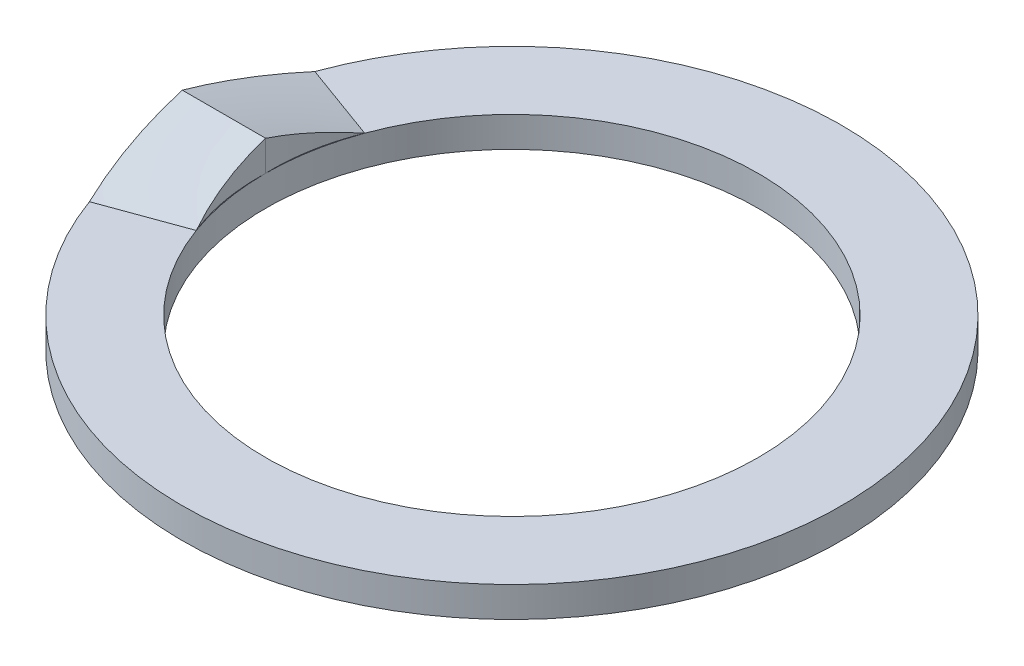
ISO-10303-21;
HEADER;
FILE_DESCRIPTION(('STEP AP214'),'2;1');
FILE_NAME('part.step','',(''),(''),'','','');
FILE_SCHEMA(('AUTOMOTIVE_DESIGN { 1 0 10303 214 1 1 1 1 }'));
ENDSEC;
DATA;
#1=APPLICATION_CONTEXT('core data for automotive mechanical design processes');
#2=APPLICATION_PROTOCOL_DEFINITION('international standard','automotive_design',2000,#1);
#3=PRODUCT_CONTEXT('',#1,'mechanical');
#4=PRODUCT('Part','Part','',(#3));
#5=PRODUCT_RELATED_PRODUCT_CATEGORY('part','',(#4));
#6=PRODUCT_DEFINITION_FORMATION('','',#4);
#7=PRODUCT_DEFINITION_CONTEXT('part definition',#1,'design');
#8=PRODUCT_DEFINITION('design','',#6,#7);
#9=PRODUCT_DEFINITION_SHAPE('','',#8);
#10=(LENGTH_UNIT() NAMED_UNIT(*) SI_UNIT(.MILLI.,.METRE.));
#11=(NAMED_UNIT(*) PLANE_ANGLE_UNIT() SI_UNIT($,.RADIAN.));
#12=(NAMED_UNIT(*) SI_UNIT($,.STERADIAN.) SOLID_ANGLE_UNIT());
#13=UNCERTAINTY_MEASURE_WITH_UNIT(LENGTH_MEASURE(1.E-05),#10,'distance_accuracy_value','');
#14=(GEOMETRIC_REPRESENTATION_CONTEXT(3) GLOBAL_UNCERTAINTY_ASSIGNED_CONTEXT((#13)) GLOBAL_UNIT_ASSIGNED_CONTEXT((#10,
#11,#12)) REPRESENTATION_CONTEXT('',''));
#15=CARTESIAN_POINT('',(0.,0.,0.));
#16=DIRECTION('',(0.,0.,1.));
#17=DIRECTION('',(1.,0.,0.));
#18=AXIS2_PLACEMENT_3D('',#15,#16,#17);
#19=CARTESIAN_POINT('',(0.,10.,0.));
#20=DIRECTION('',(0.,1.,0.));
#21=DIRECTION('',(0.,0.,1.));
#22=AXIS2_PLACEMENT_3D('',#19,#20,#21);
#23=PLANE('',#22);
#24=CARTESIAN_POINT('',(-152.70005087771,10.,55.5782732904213));
#25=CARTESIAN_POINT('',(-153.317086146041,10.,54.0235545216951));
#26=CARTESIAN_POINT('',(-153.905934350648,10.,52.4578250659601));
#27=CARTESIAN_POINT('',(-155.026817901048,10.,49.3061513481684));
#28=CARTESIAN_POINT('',(-155.558852982663,10.,47.720206992152));
#29=CARTESIAN_POINT('',(-157.068738983133,10.,42.9358392385224));
#30=CARTESIAN_POINT('',(-157.96077968991,10.,39.7098495688334));
#31=CARTESIAN_POINT('',(-159.440412776128,10.,33.5024585014175));
#32=CARTESIAN_POINT('',(-160.048474678407,10.,30.5258859290327));
#33=CARTESIAN_POINT('',(-161.070322970234,10.,24.5396154395836));
#34=CARTESIAN_POINT('',(-161.484115025148,10.,21.5299184911242));
#35=CARTESIAN_POINT('',(-162.120856086308,10.,15.4371924558219));
#36=CARTESIAN_POINT('',(-162.340358753481,10.,12.3537986653587));
#37=CARTESIAN_POINT('',(-162.515842171606,10.,7.7232167430563));
#38=CARTESIAN_POINT('',(-162.548703197381,10.,6.17859804990309));
#39=CARTESIAN_POINT('',(-162.562978128496,10.,3.08911285001207));
#40=CARTESIAN_POINT('',(-162.544391668602,10.,1.54424634159284));
#41=CARTESIAN_POINT('',(-162.5,10.,0.));
#42=B_SPLINE_CURVE_WITH_KNOTS('',3,(#24,#25,#26,#27,#28,#29,#30,#31,#32,#33,#34,#35,#36,#37,#38,
#39,#40,#41),.UNSPECIFIED.,.F.,.F.,(4,2,2,2,2,2,2,2,4),(0.,5.01746544112292,10.0349542121342,
20.0666103301966,29.1746023680965,38.2823287789988,47.5485469510787,52.182711428757,
56.8169088052858),.UNSPECIFIED.);
#43=CARTESIAN_POINT('',(-152.70005087771,10.,55.5782732904212));
#44=VERTEX_POINT('',#43);
#45=CARTESIAN_POINT('',(-162.5,10.,0.));
#46=VERTEX_POINT('',#45);
#47=EDGE_CURVE('E249',#44,#46,#42,.T.);
#48=ORIENTED_EDGE('',*,*,#47,.F.);
#49=CARTESIAN_POINT('',(0.,10.,0.));
#50=DIRECTION('',(0.,1.,0.));
#51=DIRECTION('',(0.,0.,1.));
#52=AXIS2_PLACEMENT_3D('',#49,#50,#51);
#53=CIRCLE('',#52,162.5);
#54=EDGE_CURVE('E693',#46,#44,#53,.T.);
#55=ORIENTED_EDGE('',*,*,#54,.F.);
#56=EDGE_LOOP('',(#48,#55));
#57=FACE_BOUND('',#56,.T.);
#58=ADVANCED_FACE('F223',(#57),#23,.T.);
#59=DIRECTION('',(-0.939692620785908,0.,0.342020143325669));
#60=VECTOR('',#59,1.);
#61=CARTESIAN_POINT('',(-204.383145020935,10.,74.3893811733331));
#62=LINE('',#61,#60);
#63=CARTESIAN_POINT('',(-204.383145020935,10.,74.389381173333));
#64=VERTEX_POINT('',#63);
#65=EDGE_CURVE('E241',#44,#64,#62,.T.);
#66=ORIENTED_EDGE('',*,*,#65,.T.);
#67=CARTESIAN_POINT('',(0.,10.,0.));
#68=DIRECTION('',(0.,1.,0.));
#69=DIRECTION('',(0.,0.,1.));
#70=AXIS2_PLACEMENT_3D('',#67,#68,#69);
#71=CIRCLE('',#70,217.5);
#72=CARTESIAN_POINT('',(-204.383145020935,10.,-74.3893811733331));
#73=VERTEX_POINT('',#72);
#74=EDGE_CURVE('E689',#64,#73,#71,.T.);
#75=ORIENTED_EDGE('',*,*,#74,.T.);
#76=DIRECTION('',(-0.939692620785908,0.,-0.342020143325669));
#77=VECTOR('',#76,1.);
#78=CARTESIAN_POINT('',(-204.383145020935,10.,-74.3893811733331));
#79=LINE('',#78,#77);
#80=CARTESIAN_POINT('',(-152.70005087771,10.,-55.5782732904213));
#81=VERTEX_POINT('',#80);
#82=EDGE_CURVE('E589',#81,#73,#79,.T.);
#83=ORIENTED_EDGE('',*,*,#82,.F.);
#84=EDGE_CURVE('E691',#44,#81,#53,.T.);
#85=ORIENTED_EDGE('',*,*,#84,.F.);
#86=EDGE_LOOP('',(#66,#75,#83,#85));
#87=FACE_BOUND('',#86,.T.);
#88=ADVANCED_FACE('F744',(#87),#23,.T.);
#89=CARTESIAN_POINT('',(0.,-10.,0.));
#90=DIRECTION('',(0.,1.,0.));
#91=DIRECTION('',(0.,0.,1.));
#92=AXIS2_PLACEMENT_3D('',#89,#90,#91);
#93=PLANE('',#92);
#94=CARTESIAN_POINT('',(-217.5,-10.,0.));
#95=CARTESIAN_POINT('',(-217.425850894036,-10.,3.33634458979422));
#96=CARTESIAN_POINT('',(-217.283734331814,-10.,6.67113297407033));
#97=CARTESIAN_POINT('',(-216.864965172838,-10.,13.3319308575212));
#98=CARTESIAN_POINT('',(-216.588325753956,-9.99999999999999,16.6579411845149));
#99=CARTESIAN_POINT('',(-215.901901417388,-9.99999999999999,23.2961070775179));
#100=CARTESIAN_POINT('',(-215.492119108044,-10.,26.6082629136568));
#101=CARTESIAN_POINT('',(-214.540507271924,-10.,33.2138699450945));
#102=CARTESIAN_POINT('',(-213.998666053999,-10.,36.5073194578954));
#103=CARTESIAN_POINT('',(-212.848721037228,-10.,42.7199600969706));
#104=CARTESIAN_POINT('',(-212.253845690097,-10.,45.6416081151872));
#105=CARTESIAN_POINT('',(-210.960033654815,-10.,51.4620038890468));
#106=CARTESIAN_POINT('',(-210.26108978393,-10.,54.3607500494662));
#107=CARTESIAN_POINT('',(-208.759230825878,-10.,60.1329196138594));
#108=CARTESIAN_POINT('',(-207.956257818888,-10.,63.0063279515379));
#109=CARTESIAN_POINT('',(-206.247055894203,-10.,68.7220871107759));
#110=CARTESIAN_POINT('',(-205.34083280447,-10.,71.5644396753668));
#111=CARTESIAN_POINT('',(-204.383145020935,-10.,74.3893811733331));
#112=B_SPLINE_CURVE_WITH_KNOTS('',3,(#94,#95,#96,#97,#98,#99,#100,#101,#102,#103,#104,#105,#106,
#107,#108,#109,#110,#111),.UNSPECIFIED.,.F.,.F.,(4,2,2,2,2,2,2,2,4),(0.,10.0107487240745,
20.0205169917112,30.0300891743927,40.0405478244977,48.9834722689744,57.9270142340191,
66.8755572268938,75.8235953682988),.UNSPECIFIED.);
#113=CARTESIAN_POINT('',(-213.769840690063,-9.99999999999999,37.6938995644913));
#114=VERTEX_POINT('',#113);
#115=CARTESIAN_POINT('',(-204.383145020935,-10.,74.3893811733331));
#116=VERTEX_POINT('',#115);
#117=EDGE_CURVE('E324',#114,#116,#112,.T.);
#118=ORIENTED_EDGE('',*,*,#117,.T.);
#119=CARTESIAN_POINT('',(0.,-10.,0.));
#120=DIRECTION('',(0.,1.,0.));
#121=DIRECTION('',(0.,0.,1.));
#122=AXIS2_PLACEMENT_3D('',#119,#120,#121);
#123=CIRCLE('',#122,217.5);
#124=CARTESIAN_POINT('',(-204.383145020935,-10.,-74.3893811733331));
#125=VERTEX_POINT('',#124);
#126=EDGE_CURVE('E329',#125,#116,#123,.T.);
#127=ORIENTED_EDGE('',*,*,#126,.F.);
#128=CARTESIAN_POINT('',(-204.383145020935,-10.,-74.3893811733331));
#129=CARTESIAN_POINT('',(-205.454580267854,-10.,-71.2288865345536));
#130=CARTESIAN_POINT('',(-206.46160865871,-10.,-68.0466057714099));
#131=CARTESIAN_POINT('',(-208.346231180248,-9.99999999999999,-61.6442774219037));
#132=CARTESIAN_POINT('',(-209.223838003879,-9.99999999999999,-58.4242335726179));
#133=CARTESIAN_POINT('',(-210.849191377034,-9.99999999999999,-51.9516255878924));
#134=CARTESIAN_POINT('',(-211.596940478527,-10.,-48.6990620928586));
#135=CARTESIAN_POINT('',(-212.961955018722,-10.,-42.1663483026159));
#136=CARTESIAN_POINT('',(-213.57920888014,-10.,-38.886195586565));
#137=CARTESIAN_POINT('',(-214.623447653453,-10.,-32.6549155254199));
#138=CARTESIAN_POINT('',(-215.063703490997,-10.,-29.7060038076329));
#139=CARTESIAN_POINT('',(-215.838599968877,-10.,-23.7941090234034));
#140=CARTESIAN_POINT('',(-216.173233311842,-10.,-20.8311249990657));
#141=CARTESIAN_POINT('',(-216.736143217229,-10.,-14.893394185876));
#142=CARTESIAN_POINT('',(-216.964360249274,-10.,-11.9186417497027));
#143=CARTESIAN_POINT('',(-217.313151041496,-10.,-5.9630062900678));
#144=CARTESIAN_POINT('',(-217.433730882652,-10.,-2.98212362247232));
#145=CARTESIAN_POINT('',(-217.5,-10.,0.));
#146=B_SPLINE_CURVE_WITH_KNOTS('',3,(#128,#129,#130,#131,#132,#133,#134,#135,#136,#137,#138,
#139,#140,#141,#142,#143,#144,#145),.UNSPECIFIED.,.F.,.F.,(4,2,2,2,2,2,2,2,4),(0.,
10.0107512961125,20.0205201394985,30.0300922483265,40.040552014586,48.9834773803632,
57.9270204702527,66.8755606854243,75.8235953195433),.UNSPECIFIED.);
#147=CARTESIAN_POINT('',(-213.769840690063,-9.99999999999999,-37.6938995644913));
#148=VERTEX_POINT('',#147);
#149=EDGE_CURVE('E722',#125,#148,#146,.T.);
#150=ORIENTED_EDGE('',*,*,#149,.T.);
#151=CARTESIAN_POINT('',(-155.094138911286,-10.,-27.3477902289091));
#152=CARTESIAN_POINT('',(-156.872190480335,-10.,-27.661308693647));
#153=CARTESIAN_POINT('',(-158.650242049386,-10.,-27.9748271583779));
#154=CARTESIAN_POINT('',(-164.94199581974,-10.,-29.0842331041012));
#155=CARTESIAN_POINT('',(-169.455698021049,-10.,-29.8801205850614));
#156=CARTESIAN_POINT('',(-178.483102423673,-10.,-31.4718955469384));
#157=CARTESIAN_POINT('',(-182.996804624989,-10.,-32.2677830278552));
#158=CARTESIAN_POINT('',(-192.02420902761,-9.99999999999999,-33.8595579897505));
#159=CARTESIAN_POINT('',(-196.537911228915,-9.99999999999999,-34.6554454707289));
#160=CARTESIAN_POINT('',(-207.069074085886,-9.99999999999999,-36.512373620697));
#161=CARTESIAN_POINT('',(-213.08653474155,-9.99999999999999,-37.5734142896987));
#162=CARTESIAN_POINT('',(-219.103995397214,-10.,-38.6344549586917));
#163=B_SPLINE_CURVE_WITH_KNOTS('',3,(#151,#152,#153,#154,#155,#156,#157,#158,#159,#160,#161,
#162),.UNSPECIFIED.,.F.,.F.,(4,2,2,2,2,4),(0.,5.41644264156718,19.1664426415676,
32.9164426415679,46.6664426415683,64.9973116988058),.UNSPECIFIED.);
#164=CARTESIAN_POINT('',(-160.428293618447,-10.,-28.2883456230553));
#165=VERTEX_POINT('',#164);
#166=EDGE_CURVE('E233',#148,#165,#163,.F.);
#167=ORIENTED_EDGE('',*,*,#166,.T.);
#168=CARTESIAN_POINT('',(-162.5,-10.,0.));
#169=CARTESIAN_POINT('',(-162.54806156742,-10.,-1.67199453792795));
#170=CARTESIAN_POINT('',(-162.565874602785,-10.,-3.34469483734242));
#171=CARTESIAN_POINT('',(-162.541207623611,-9.99999999999999,-6.68965989156582));
#172=CARTESIAN_POINT('',(-162.498727323081,-9.99999999999998,-8.36192464427118));
#173=CARTESIAN_POINT('',(-162.281200063599,-10.,-13.3741680358731));
#174=CARTESIAN_POINT('',(-162.016098190012,-10.0000000000002,-16.7107019451459));
#175=CARTESIAN_POINT('',(-161.283469681927,-10.0000000000002,-23.0498074034538));
#176=CARTESIAN_POINT('',(-160.836828736567,-10.0000000000001,-26.0548421098906));
#177=CARTESIAN_POINT('',(-159.749657336494,-9.99999999999994,-32.0295927500768));
#178=CARTESIAN_POINT('',(-159.10913261911,-10.,-34.999309726232));
#179=CARTESIAN_POINT('',(-157.623657854408,-10.,-40.9423831520845));
#180=CARTESIAN_POINT('',(-156.775344172556,-10.,-43.9149035110329));
#181=CARTESIAN_POINT('',(-155.356483478295,-10.,-48.3262477509481));
#182=CARTESIAN_POINT('',(-154.859066339023,-10.,-49.7889542255324));
#183=CARTESIAN_POINT('',(-153.815796785975,-10.,-52.6970017411244));
#184=CARTESIAN_POINT('',(-153.269944024813,-10.,-54.1423426574997));
#185=CARTESIAN_POINT('',(-152.70005087771,-10.,-55.5782732904213));
#186=B_SPLINE_CURVE_WITH_KNOTS('',3,(#168,#169,#170,#171,#172,#173,#174,#175,#176,#177,#178,
#179,#180,#181,#182,#183,#184,#185),.UNSPECIFIED.,.F.,.F.,(4,2,2,2,2,2,2,2,4),(0.,
5.01745907390901,10.0349419473603,20.0665956551383,29.1745869590819,38.2823087693499,
47.5485328951989,52.1827042526712,56.8169088496613),.UNSPECIFIED.);
#187=CARTESIAN_POINT('',(-152.70005087771,-10.,-55.5782732904213));
#188=VERTEX_POINT('',#187);
#189=EDGE_CURVE('E301',#165,#188,#186,.T.);
#190=ORIENTED_EDGE('',*,*,#189,.T.);
#191=CARTESIAN_POINT('',(0.,-10.,0.));
#192=DIRECTION('',(0.,1.,0.));
#193=DIRECTION('',(0.,0.,1.));
#194=AXIS2_PLACEMENT_3D('',#191,#192,#193);
#195=CIRCLE('',#194,162.5);
#196=CARTESIAN_POINT('',(-152.70005087771,-10.,55.5782732904213));
#197=VERTEX_POINT('',#196);
#198=EDGE_CURVE('E294',#188,#197,#195,.T.);
#199=ORIENTED_EDGE('',*,*,#198,.T.);
#200=CARTESIAN_POINT('',(-152.70005087771,-10.,55.5782732904213));
#201=CARTESIAN_POINT('',(-153.317086146041,-10.,54.0235545216951));
#202=CARTESIAN_POINT('',(-153.905934350648,-10.,52.4578250659601));
#203=CARTESIAN_POINT('',(-155.026817901048,-10.,49.3061513481684));
#204=CARTESIAN_POINT('',(-155.558852982663,-10.,47.720206992152));
#205=CARTESIAN_POINT('',(-157.068738983134,-10.,42.9358392385224));
#206=CARTESIAN_POINT('',(-157.96077968991,-10.,39.7098495688334));
#207=CARTESIAN_POINT('',(-159.440412776128,-10.,33.5024585014176));
#208=CARTESIAN_POINT('',(-160.048474678407,-10.,30.5258859290327));
#209=CARTESIAN_POINT('',(-161.070322970234,-9.99999999999999,24.5396154395836));
#210=CARTESIAN_POINT('',(-161.484115025148,-9.99999999999999,21.5299184911242));
#211=CARTESIAN_POINT('',(-162.120856086308,-9.99999999999999,15.4371924558219));
#212=CARTESIAN_POINT('',(-162.34035875348,-10.,12.3537986653587));
#213=CARTESIAN_POINT('',(-162.515842171606,-10.,7.72321674305629));
#214=CARTESIAN_POINT('',(-162.548703197381,-10.,6.17859804990308));
#215=CARTESIAN_POINT('',(-162.562978128496,-10.,3.08911285001207));
#216=CARTESIAN_POINT('',(-162.544391668602,-10.,1.54424634159284));
#217=CARTESIAN_POINT('',(-162.5,-10.,0.));
#218=B_SPLINE_CURVE_WITH_KNOTS('',3,(#200,#201,#202,#203,#204,#205,#206,#207,#208,#209,#210,
#211,#212,#213,#214,#215,#216,#217),.UNSPECIFIED.,.F.,.F.,(4,2,2,2,2,2,2,2,4),(0.,
5.0174654411229,10.0349542121342,20.0666103301966,29.1746023680965,38.2823287789988,
47.5485469510787,52.182711428757,56.8169088052858),.UNSPECIFIED.);
#219=CARTESIAN_POINT('',(-160.428293618447,-10.,28.2883456230553));
#220=VERTEX_POINT('',#219);
#221=EDGE_CURVE('E298',#197,#220,#218,.T.);
#222=ORIENTED_EDGE('',*,*,#221,.T.);
#223=CARTESIAN_POINT('',(-155.094138911286,-10.,27.3477902289091));
#224=CARTESIAN_POINT('',(-156.872190480335,-10.,27.661308693647));
#225=CARTESIAN_POINT('',(-158.650242049386,-10.,27.9748271583779));
#226=CARTESIAN_POINT('',(-164.94199581974,-10.,29.0842331041012));
#227=CARTESIAN_POINT('',(-169.455698021049,-10.,29.8801205850614));
#228=CARTESIAN_POINT('',(-178.483102423673,-10.,31.4718955469384));
#229=CARTESIAN_POINT('',(-182.996804624989,-9.99999999999999,32.2677830278552));
#230=CARTESIAN_POINT('',(-192.02420902761,-9.99999999999999,33.8595579897505));
#231=CARTESIAN_POINT('',(-196.537911228915,-9.99999999999998,34.6554454707289));
#232=CARTESIAN_POINT('',(-207.069074085886,-9.99999999999998,36.512373620697));
#233=CARTESIAN_POINT('',(-213.08653474155,-9.99999999999999,37.5734142896987));
#234=CARTESIAN_POINT('',(-219.103995397214,-10.,38.6344549586917));
#235=B_SPLINE_CURVE_WITH_KNOTS('',3,(#223,#224,#225,#226,#227,#228,#229,#230,#231,#232,#233,
#234),.UNSPECIFIED.,.F.,.F.,(4,2,2,2,2,4),(0.,5.41644264156718,19.1664426415676,
32.9164426415679,46.6664426415683,64.9973116988058),.UNSPECIFIED.);
#236=EDGE_CURVE('E13',#220,#114,#235,.T.);
#237=ORIENTED_EDGE('',*,*,#236,.T.);
#238=EDGE_LOOP('',(#118,#127,#150,#167,#190,#199,#222,#237));
#239=FACE_BOUND('',#238,.T.);
#240=ADVANCED_FACE('F297',(#239),#93,.F.);
#241=CARTESIAN_POINT('',(-217.5,10.,0.));
#242=CARTESIAN_POINT('',(-217.425850894036,10.,3.33634458979423));
#243=CARTESIAN_POINT('',(-217.283734331814,10.,6.67113297407034));
#244=CARTESIAN_POINT('',(-216.864965172838,10.,13.3319308575212));
#245=CARTESIAN_POINT('',(-216.588325753956,10.,16.6579411845149));
#246=CARTESIAN_POINT('',(-215.901901417388,10.,23.2961070775179));
#247=CARTESIAN_POINT('',(-215.492119108044,10.,26.6082629136568));
#248=CARTESIAN_POINT('',(-214.540507271924,10.,33.2138699450945));
#249=CARTESIAN_POINT('',(-213.998666053999,10.,36.5073194578954));
#250=CARTESIAN_POINT('',(-212.848721037228,10.,42.7199600969706));
#251=CARTESIAN_POINT('',(-212.253845690097,10.,45.6416081151872));
#252=CARTESIAN_POINT('',(-210.960033654815,10.,51.4620038890468));
#253=CARTESIAN_POINT('',(-210.26108978393,10.,54.3607500494662));
#254=CARTESIAN_POINT('',(-208.759230825878,10.,60.1329196138594));
#255=CARTESIAN_POINT('',(-207.956257818888,10.,63.0063279515379));
#256=CARTESIAN_POINT('',(-206.247055894203,10.,68.7220871107759));
#257=CARTESIAN_POINT('',(-205.34083280447,10.,71.5644396753668));
#258=CARTESIAN_POINT('',(-204.383145020935,10.,74.3893811733331));
#259=B_SPLINE_CURVE_WITH_KNOTS('',3,(#241,#242,#243,#244,#245,#246,#247,#248,#249,#250,#251,
#252,#253,#254,#255,#256,#257,#258),.UNSPECIFIED.,.F.,.F.,(4,2,2,2,2,2,2,2,4),(0.,
10.0107487240745,20.0205169917112,30.0300891743927,40.0405478244977,48.9834722689744,
57.9270142340191,66.8755572268938,75.8235953682988),.UNSPECIFIED.);
#260=CARTESIAN_POINT('',(-217.5,10.,0.));
#261=VERTEX_POINT('',#260);
#262=EDGE_CURVE('E314',#261,#64,#259,.T.);
#263=ORIENTED_EDGE('',*,*,#262,.F.);
#264=EDGE_CURVE('E687',#261,#64,#71,.T.);
#265=ORIENTED_EDGE('',*,*,#264,.T.);
#266=EDGE_LOOP('',(#263,#265));
#267=FACE_BOUND('',#266,.T.);
#268=ADVANCED_FACE('F748',(#267),#23,.T.);
#269=CARTESIAN_POINT('',(-162.5,10.,0.));
#270=CARTESIAN_POINT('',(-162.54806156742,10.,-1.67199453792795));
#271=CARTESIAN_POINT('',(-162.565874602785,10.,-3.34469483734243));
#272=CARTESIAN_POINT('',(-162.541207623611,10.,-6.68965989156583));
#273=CARTESIAN_POINT('',(-162.498727323081,10.,-8.36192464427119));
#274=CARTESIAN_POINT('',(-162.281200063599,10.,-13.3741680358731));
#275=CARTESIAN_POINT('',(-162.016098190012,10.,-16.7107019451459));
#276=CARTESIAN_POINT('',(-161.283469681927,10.,-23.0498074034538));
#277=CARTESIAN_POINT('',(-160.836828736567,10.,-26.0548421098907));
#278=CARTESIAN_POINT('',(-159.749657336494,10.,-32.0295927500768));
#279=CARTESIAN_POINT('',(-159.10913261911,10.,-34.999309726232));
#280=CARTESIAN_POINT('',(-157.623657854408,10.,-40.9423831520845));
#281=CARTESIAN_POINT('',(-156.775344172556,10.,-43.9149035110329));
#282=CARTESIAN_POINT('',(-155.356483478295,10.,-48.3262477509481));
#283=CARTESIAN_POINT('',(-154.859066339023,10.,-49.7889542255324));
#284=CARTESIAN_POINT('',(-153.815796785975,10.,-52.6970017411244));
#285=CARTESIAN_POINT('',(-153.269944024813,10.,-54.1423426574997));
#286=CARTESIAN_POINT('',(-152.70005087771,10.,-55.5782732904213));
#287=B_SPLINE_CURVE_WITH_KNOTS('',3,(#269,#270,#271,#272,#273,#274,#275,#276,#277,#278,#279,
#280,#281,#282,#283,#284,#285,#286),.UNSPECIFIED.,.F.,.F.,(4,2,2,2,2,2,2,2,4),(0.,
5.01745907390902,10.0349419473603,20.0665956551383,29.1745869590819,38.28230876935,
47.5485328951989,52.1827042526712,56.8169088496613),.UNSPECIFIED.);
#288=EDGE_CURVE('E587',#46,#81,#287,.T.);
#289=ORIENTED_EDGE('',*,*,#288,.F.);
#290=EDGE_CURVE('E713',#81,#46,#53,.T.);
#291=ORIENTED_EDGE('',*,*,#290,.F.);
#292=EDGE_LOOP('',(#289,#291));
#293=FACE_BOUND('',#292,.T.);
#294=ADVANCED_FACE('F750',(#293),#23,.T.);
#295=CARTESIAN_POINT('',(0.,-10.,0.));
#296=DIRECTION('',(0.,1.,0.));
#297=DIRECTION('',(0.,0.,1.));
#298=AXIS2_PLACEMENT_3D('',#295,#296,#297);
#299=CYLINDRICAL_SURFACE('',#298,217.5);
#300=ORIENTED_EDGE('',*,*,#126,.T.);
#301=EDGE_CURVE('E323',#116,#125,#123,.T.);
#302=ORIENTED_EDGE('',*,*,#301,.T.);
#303=EDGE_LOOP('',(#300,#302));
#304=FACE_BOUND('',#303,.T.);
#305=ORIENTED_EDGE('',*,*,#74,.F.);
#306=ORIENTED_EDGE('',*,*,#264,.F.);
#307=EDGE_CURVE('E688',#73,#261,#71,.T.);
#308=ORIENTED_EDGE('',*,*,#307,.F.);
#309=EDGE_LOOP('',(#305,#306,#308));
#310=FACE_BOUND('',#309,.T.);
#311=ADVANCED_FACE('F225',(#304,#310),#299,.T.);
#312=CARTESIAN_POINT('',(0.,-10.,0.));
#313=DIRECTION('',(0.,1.,0.));
#314=DIRECTION('',(0.,0.,1.));
#315=AXIS2_PLACEMENT_3D('',#312,#313,#314);
#316=CYLINDRICAL_SURFACE('',#315,162.5);
#317=EDGE_CURVE('E306',#197,#188,#195,.T.);
#318=ORIENTED_EDGE('',*,*,#317,.F.);
#319=ORIENTED_EDGE('',*,*,#198,.F.);
#320=EDGE_LOOP('',(#318,#319));
#321=FACE_BOUND('',#320,.T.);
#322=ORIENTED_EDGE('',*,*,#54,.T.);
#323=ORIENTED_EDGE('',*,*,#84,.T.);
#324=ORIENTED_EDGE('',*,*,#290,.T.);
#325=EDGE_LOOP('',(#322,#323,#324));
#326=FACE_BOUND('',#325,.T.);
#327=ADVANCED_FACE('F327',(#321,#326),#316,.F.);
#328=ORIENTED_EDGE('',*,*,#301,.F.);
#329=DIRECTION('',(0.939692620785908,0.,-0.342020143325669));
#330=VECTOR('',#329,1.);
#331=CARTESIAN_POINT('',(-204.383145020935,-10.,74.3893811733331));
#332=LINE('',#331,#330);
#333=EDGE_CURVE('E227',#116,#197,#332,.T.);
#334=ORIENTED_EDGE('',*,*,#333,.T.);
#335=ORIENTED_EDGE('',*,*,#317,.T.);
#336=DIRECTION('',(0.939692620785908,0.,0.342020143325669));
#337=VECTOR('',#336,1.);
#338=CARTESIAN_POINT('',(-204.383145020935,-10.,-74.3893811733331));
#339=LINE('',#338,#337);
#340=EDGE_CURVE('E723',#125,#188,#339,.T.);
#341=ORIENTED_EDGE('',*,*,#340,.F.);
#342=EDGE_LOOP('',(#328,#334,#335,#341));
#343=FACE_BOUND('',#342,.T.);
#344=ADVANCED_FACE('F320',(#343),#93,.F.);
#345=CARTESIAN_POINT('',(-204.383145020935,10.,-74.3893811733331));
#346=CARTESIAN_POINT('',(-205.454580267854,10.,-71.2288865345535));
#347=CARTESIAN_POINT('',(-206.46160865871,10.,-68.0466057714099));
#348=CARTESIAN_POINT('',(-208.346231180248,10.,-61.6442774219036));
#349=CARTESIAN_POINT('',(-209.223838003879,10.,-58.4242335726179));
#350=CARTESIAN_POINT('',(-210.849191377034,10.,-51.9516255878924));
#351=CARTESIAN_POINT('',(-211.596940478527,10.,-48.6990620928586));
#352=CARTESIAN_POINT('',(-212.961955018722,10.,-42.1663483026159));
#353=CARTESIAN_POINT('',(-213.57920888014,10.,-38.886195586565));
#354=CARTESIAN_POINT('',(-214.623447653453,10.,-32.6549155254199));
#355=CARTESIAN_POINT('',(-215.063703490997,10.,-29.7060038076329));
#356=CARTESIAN_POINT('',(-215.838599968877,10.,-23.7941090234035));
#357=CARTESIAN_POINT('',(-216.173233311842,10.,-20.8311249990657));
#358=CARTESIAN_POINT('',(-216.736143217229,10.,-14.893394185876));
#359=CARTESIAN_POINT('',(-216.964360249274,10.,-11.9186417497027));
#360=CARTESIAN_POINT('',(-217.313151041497,10.,-5.9630062900678));
#361=CARTESIAN_POINT('',(-217.433730882652,10.,-2.98212362247232));
#362=CARTESIAN_POINT('',(-217.5,10.,0.));
#363=B_SPLINE_CURVE_WITH_KNOTS('',3,(#345,#346,#347,#348,#349,#350,#351,#352,#353,#354,#355,
#356,#357,#358,#359,#360,#361,#362),.UNSPECIFIED.,.F.,.F.,(4,2,2,2,2,2,2,2,4),(0.,
10.0107512961125,20.0205201394985,30.0300922483265,40.040552014586,48.9834773803632,
57.9270204702527,66.8755606854243,75.8235953195433),.UNSPECIFIED.);
#364=EDGE_CURVE('E305',#73,#261,#363,.T.);
#365=ORIENTED_EDGE('',*,*,#364,.F.);
#366=ORIENTED_EDGE('',*,*,#307,.T.);
#367=EDGE_LOOP('',(#365,#366));
#368=FACE_BOUND('',#367,.T.);
#369=ADVANCED_FACE('F359',(#368),#23,.T.);
#370=CARTESIAN_POINT('',(-152.70005087771,-10.,-55.5782732904213));
#371=CARTESIAN_POINT('',(-159.696990852919,-10.0034391028743,-37.9485724574479));
#372=CARTESIAN_POINT('',(-163.045108503745,-9.99656089712564,-18.960924773656));
#373=CARTESIAN_POINT('',(-162.5,-10.,0.));
#374=CARTESIAN_POINT('',(-152.70005087771,-8.33333333333333,-55.5782732904213));
#375=CARTESIAN_POINT('',(-159.696990852919,-7.78121688065211,-37.9485724574479));
#376=CARTESIAN_POINT('',(-163.045108503745,-7.21878311934787,-18.960924773656));
#377=CARTESIAN_POINT('',(-162.5,-6.66666666666667,0.));
#378=CARTESIAN_POINT('',(-152.70005087771,-5.,-55.5782732904213));
#379=CARTESIAN_POINT('',(-159.696990852919,-3.33677243620767,-37.9485724574479));
#380=CARTESIAN_POINT('',(-163.045108503745,-1.66322756379231,-18.960924773656));
#381=CARTESIAN_POINT('',(-162.5,0.,0.));
#382=CARTESIAN_POINT('',(-152.70005087771,0.,-55.5782732904214));
#383=CARTESIAN_POINT('',(-159.696990852919,3.329894230459,-37.948572457448));
#384=CARTESIAN_POINT('',(-163.045108503745,6.67010576954102,-18.9609247736561));
#385=CARTESIAN_POINT('',(-162.5,10.,0.));
#386=CARTESIAN_POINT('',(-152.70005087771,5.,-55.5782732904212));
#387=CARTESIAN_POINT('',(-159.696990852918,9.99656089712566,-37.9485724574479));
#388=CARTESIAN_POINT('',(-163.045108503745,15.0034391028744,-18.960924773656));
#389=CARTESIAN_POINT('',(-162.5,20.,0.));
#390=CARTESIAN_POINT('',(-152.70005087771,8.33333333333333,-55.5782732904213));
#391=CARTESIAN_POINT('',(-159.696990852919,14.4410053415701,-37.9485724574479));
#392=CARTESIAN_POINT('',(-163.045108503745,20.5589946584299,-18.960924773656));
#393=CARTESIAN_POINT('',(-162.5,26.6666666666667,0.));
#394=CARTESIAN_POINT('',(-152.70005087771,10.,-55.5782732904213));
#395=CARTESIAN_POINT('',(-159.696990852919,16.6632275637923,-37.9485724574479));
#396=CARTESIAN_POINT('',(-163.045108503745,23.3367724362077,-18.960924773656));
#397=CARTESIAN_POINT('',(-162.5,30.,0.));
#398=B_SPLINE_SURFACE_WITH_KNOTS('',3,3,((#370,#371,#372,#373),(#374,#375,#376,#377),(#378,#379,
#380,#381),(#382,#383,#384,#385),(#386,#387,#388,#389),(#390,#391,#392,#393),(#394,#395,#396,
#397)),.UNSPECIFIED.,.F.,.F.,.F.,(4,1,1,1,4),(4,4),(0.5,0.542982456140351,0.585964912280702,
0.628947368421053,0.671929824561404),(0.,1.),.UNSPECIFIED.);
#399=DIRECTION('',(0.,1.,0.));
#400=VECTOR('',#399,1.);
#401=CARTESIAN_POINT('',(-162.5,-10.,0.));
#402=LINE('',#401,#400);
#403=CARTESIAN_POINT('',(-162.5,30.,0.));
#404=VERTEX_POINT('',#403);
#405=EDGE_CURVE('E451',#46,#404,#402,.T.);
#406=CARTESIAN_POINT('',(-152.70005087771,10.,-55.5782732904213));
#407=CARTESIAN_POINT('',(-159.696990852919,16.6632275637923,-37.9485724574479));
#408=CARTESIAN_POINT('',(-163.045108503745,23.3367724362077,-18.960924773656));
#409=CARTESIAN_POINT('',(-162.5,30.,0.));
#410=B_SPLINE_CURVE_WITH_KNOTS('',3,(#406,#407,#408,#409),.UNSPECIFIED.,.F.,.F.,(4,4),(0.,1.),.UNSPECIFIED.);
#411=EDGE_CURVE('E454',#81,#404,#410,.T.);
#412=ORIENTED_EDGE('',*,*,#405,.F.);
#413=ORIENTED_EDGE('',*,*,#288,.T.);
#414=ORIENTED_EDGE('',*,*,#411,.T.);
#415=EDGE_LOOP('',(#412,#413,#414));
#416=FACE_BOUND('',#415,.T.);
#417=ADVANCED_FACE('F586',(#416),#398,.T.);
#418=CARTESIAN_POINT('',(-204.383145020935,10.,-74.3893811733331));
#419=CARTESIAN_POINT('',(-212.485720281735,16.6632275637923,-50.4893110460558));
#420=CARTESIAN_POINT('',(-216.939473218153,23.3367724362077,-25.23129406796));
#421=CARTESIAN_POINT('',(-217.5,30.,0.));
#422=CARTESIAN_POINT('',(-204.383145020935,8.33333333333334,-74.3893811733331));
#423=CARTESIAN_POINT('',(-212.485720281735,14.4410053415701,-50.4893110460558));
#424=CARTESIAN_POINT('',(-216.939473218153,20.5589946584299,-25.23129406796));
#425=CARTESIAN_POINT('',(-217.5,26.6666666666667,0.));
#426=CARTESIAN_POINT('',(-204.383145020935,5.00000000000001,-74.389381173333));
#427=CARTESIAN_POINT('',(-212.485720281735,9.99656089712567,-50.4893110460558));
#428=CARTESIAN_POINT('',(-216.939473218153,15.0034391028744,-25.23129406796));
#429=CARTESIAN_POINT('',(-217.5,20.,0.));
#430=CARTESIAN_POINT('',(-204.383145020935,0.,-74.3893811733332));
#431=CARTESIAN_POINT('',(-212.485720281735,3.329894230459,-50.4893110460559));
#432=CARTESIAN_POINT('',(-216.939473218153,6.67010576954102,-25.23129406796));
#433=CARTESIAN_POINT('',(-217.5,9.99999999999999,0.));
#434=CARTESIAN_POINT('',(-204.383145020935,-5.,-74.3893811733331));
#435=CARTESIAN_POINT('',(-212.485720281735,-3.33677243620766,-50.4893110460558));
#436=CARTESIAN_POINT('',(-216.939473218153,-1.6632275637923,-25.23129406796));
#437=CARTESIAN_POINT('',(-217.5,0.,0.));
#438=CARTESIAN_POINT('',(-204.383145020935,-8.33333333333333,-74.3893811733331));
#439=CARTESIAN_POINT('',(-212.485720281735,-7.78121688065211,-50.4893110460558));
#440=CARTESIAN_POINT('',(-216.939473218153,-7.21878311934787,-25.23129406796));
#441=CARTESIAN_POINT('',(-217.5,-6.66666666666667,0.));
#442=CARTESIAN_POINT('',(-204.383145020935,-10.,-74.3893811733331));
#443=CARTESIAN_POINT('',(-212.485720281735,-10.0034391028743,-50.4893110460558));
#444=CARTESIAN_POINT('',(-216.939473218153,-9.99656089712564,-25.23129406796));
#445=CARTESIAN_POINT('',(-217.5,-10.,0.));
#446=B_SPLINE_SURFACE_WITH_KNOTS('',3,3,((#418,#419,#420,#421),(#422,#423,#424,#425),(#426,#427,
#428,#429),(#430,#431,#432,#433),(#434,#435,#436,#437),(#438,#439,#440,#441),(#442,#443,#444,
#445)),.UNSPECIFIED.,.F.,.F.,.F.,(4,1,1,1,4),(4,4),(0.,0.0429824561403509,0.0859649122807017,
0.128947368421053,0.171929824561404),(0.,1.),.UNSPECIFIED.);
#447=CARTESIAN_POINT('',(-204.383145020935,10.,-74.3893811733331));
#448=CARTESIAN_POINT('',(-212.485720281735,16.6632275637923,-50.4893110460558));
#449=CARTESIAN_POINT('',(-216.939473218153,23.3367724362077,-25.23129406796));
#450=CARTESIAN_POINT('',(-217.5,30.,0.));
#451=B_SPLINE_CURVE_WITH_KNOTS('',3,(#447,#448,#449,#450),.UNSPECIFIED.,.F.,.F.,(4,4),(0.,1.),.UNSPECIFIED.);
#452=CARTESIAN_POINT('',(-217.5,30.,0.));
#453=VERTEX_POINT('',#452);
#454=EDGE_CURVE('E581',#73,#453,#451,.T.);
#455=DIRECTION('',(0.,-1.,0.));
#456=VECTOR('',#455,1.);
#457=CARTESIAN_POINT('',(-217.5,-10.,0.));
#458=LINE('',#457,#456);
#459=EDGE_CURVE('E433',#453,#261,#458,.T.);
#460=ORIENTED_EDGE('',*,*,#454,.F.);
#461=ORIENTED_EDGE('',*,*,#364,.T.);
#462=ORIENTED_EDGE('',*,*,#459,.F.);
#463=EDGE_LOOP('',(#460,#461,#462));
#464=FACE_BOUND('',#463,.T.);
#465=ADVANCED_FACE('F617',(#464),#446,.T.);
#466=CARTESIAN_POINT('',(-152.70005087771,10.,-55.5782732904213));
#467=CARTESIAN_POINT('',(-159.696990852919,16.6632275637923,-37.9485724574479));
#468=CARTESIAN_POINT('',(-163.045108503745,23.3367724362077,-18.960924773656));
#469=CARTESIAN_POINT('',(-162.5,30.,0.));
#470=CARTESIAN_POINT('',(-154.516155949709,10.,-56.2392814789287));
#471=CARTESIAN_POINT('',(-161.823197297482,16.6632275637923,-38.3892445831195));
#472=CARTESIAN_POINT('',(-165.481416320873,23.3367724362077,-19.1812608364918));
#473=CARTESIAN_POINT('',(-165.246409189694,30.,0.));
#474=CARTESIAN_POINT('',(-158.391810360082,10.,-57.6499043226071));
#475=CARTESIAN_POINT('',(-166.037547285717,16.6632275637923,-39.3296598122385));
#476=CARTESIAN_POINT('',(-170.034461886969,23.3367724362077,-19.6514684510513));
#477=CARTESIAN_POINT('',(-170.138150333651,29.9999999999999,0.));
#478=CARTESIAN_POINT('',(-164.922882710309,10.,-60.0270202559289));
#479=CARTESIAN_POINT('',(-172.623345528263,16.6632275637924,-40.9144037677863));
#480=CARTESIAN_POINT('',(-176.674986021835,23.3367724362077,-20.4438404288253));
#481=CARTESIAN_POINT('',(-176.833400360835,30.0000000000001,0.));
#482=CARTESIAN_POINT('',(-171.871497800387,10.,-62.5561093180902));
#483=CARTESIAN_POINT('',(-179.413237479432,16.6632275637923,-42.6004631425606));
#484=CARTESIAN_POINT('',(-183.306154834094,23.3367724362077,-21.2868701162124));
#485=CARTESIAN_POINT('',(-183.305846034185,30.,0.));
#486=CARTESIAN_POINT('',(-176.388136093258,10.,-64.2000312156422));
#487=CARTESIAN_POINT('',(-183.891821724431,16.6632275637923,-43.6964110742619));
#488=CARTESIAN_POINT('',(-187.746685031221,23.3367724362077,-21.834844082063));
#489=CARTESIAN_POINT('',(-187.70832218344,30.,0.));
#490=CARTESIAN_POINT('',(-180.695060605194,10.,-65.7676235392182));
#491=CARTESIAN_POINT('',(-188.290882510166,16.6632275637923,-44.7414726233126));
#492=CARTESIAN_POINT('',(-192.237882090755,23.3367724362077,-22.3573748565884));
#493=CARTESIAN_POINT('',(-192.291655516773,30.,0.));
#494=CARTESIAN_POINT('',(-185.211699616893,10.,-67.4115456984022));
#495=CARTESIAN_POINT('',(-192.769468257582,16.6632275637923,-45.8374207294352));
#496=CARTESIAN_POINT('',(-196.67841457389,23.3367724362077,-22.9053489096497));
#497=CARTESIAN_POINT('',(-196.694134735626,30.,0.));
#498=CARTESIAN_POINT('',(-192.160313553358,10.,-69.9406343406826));
#499=CARTESIAN_POINT('',(-199.559361540665,16.6632275637923,-47.5234798242888));
#500=CARTESIAN_POINT('',(-203.30958720359,23.3367724362077,-23.7483784570765));
#501=CARTESIAN_POINT('',(-203.166586711945,30.,0.));
#502=CARTESIAN_POINT('',(-198.691384904547,10.,-72.3177499103842));
#503=CARTESIAN_POINT('',(-206.145161424171,16.6632275637923,-49.1082235374232));
#504=CARTESIAN_POINT('',(-209.950115619412,23.3367724362077,-24.5407503136437));
#505=CARTESIAN_POINT('',(-209.861843660083,30.,0.));
#506=CARTESIAN_POINT('',(-202.567039603756,10.,-73.7283728591903));
#507=CARTESIAN_POINT('',(-210.359513119066,16.6632275637923,-50.0486388366273));
#508=CARTESIAN_POINT('',(-214.503164309994,23.3367724362077,-25.0109579632457));
#509=CARTESIAN_POINT('',(-214.753589346352,30.,0.));
#510=CARTESIAN_POINT('',(-204.383145020935,10.,-74.3893811733331));
#511=CARTESIAN_POINT('',(-212.485720281735,16.6632275637923,-50.4893110460558));
#512=CARTESIAN_POINT('',(-216.939473218153,23.3367724362077,-25.23129406796));
#513=CARTESIAN_POINT('',(-217.5,30.,0.));
#514=B_SPLINE_SURFACE_WITH_KNOTS('',3,3,((#466,#467,#468,#469),(#470,#471,#472,#473),(#474,#475,
#476,#477),(#478,#479,#480,#481),(#482,#483,#484,#485),(#486,#487,#488,#489),(#490,#491,#492,
#493),(#494,#495,#496,#497),(#498,#499,#500,#501),(#502,#503,#504,#505),(#506,#507,#508,#509),
(#510,#511,#512,#513)),.UNSPECIFIED.,.F.,.F.,.F.,(4,1,1,1,2,1,1,1,4),(4,4),(0.671929824561404,
0.712938588875793,0.753947353190182,0.794956117504571,0.83596488181896,0.87697366136422,
0.91798244090948,0.95899122045474,1.),(0.,1.),.UNSPECIFIED.);
#515=DIRECTION('',(-1.,0.,0.));
#516=VECTOR('',#515,1.);
#517=CARTESIAN_POINT('',(-217.5,30.,0.));
#518=LINE('',#517,#516);
#519=EDGE_CURVE('E442',#404,#453,#518,.T.);
#520=ORIENTED_EDGE('',*,*,#82,.T.);
#521=ORIENTED_EDGE('',*,*,#454,.T.);
#522=ORIENTED_EDGE('',*,*,#519,.F.);
#523=ORIENTED_EDGE('',*,*,#411,.F.);
#524=EDGE_LOOP('',(#520,#521,#522,#523));
#525=FACE_BOUND('',#524,.T.);
#526=ADVANCED_FACE('F579',(#525),#514,.T.);
#527=CARTESIAN_POINT('',(-204.383145020935,-10.,-74.3893811733331));
#528=CARTESIAN_POINT('',(-212.485720281735,-10.0034391028743,-50.4893110460558));
#529=CARTESIAN_POINT('',(-216.939473218153,-9.99656089712564,-25.23129406796));
#530=CARTESIAN_POINT('',(-217.5,-10.,0.));
#531=CARTESIAN_POINT('',(-200.076220509,-10.,-72.8217888497571));
#532=CARTESIAN_POINT('',(-208.086659496,-10.0034391028743,-49.4442494970052));
#533=CARTESIAN_POINT('',(-212.448276158619,-9.99656089712564,-24.7087632934347));
#534=CARTESIAN_POINT('',(-212.916666666667,-10.,0.));
#535=CARTESIAN_POINT('',(-191.462371485129,-10.,-69.6866042026052));
#536=CARTESIAN_POINT('',(-199.288537924531,-10.0034391028743,-47.3541263989039));
#537=CARTESIAN_POINT('',(-203.465882039551,-9.99656089712564,-23.663701744384));
#538=CARTESIAN_POINT('',(-203.75,-10.,0.));
#539=CARTESIAN_POINT('',(-178.541597949323,-10.,-64.9838272318772));
#540=CARTESIAN_POINT('',(-186.091355567327,-10.0034391028743,-44.2189417517518));
#541=CARTESIAN_POINT('',(-189.992290860949,-9.99656089712565,-22.096109420808));
#542=CARTESIAN_POINT('',(-190.,-10.,0.));
#543=CARTESIAN_POINT('',(-165.620824413516,-10.,-60.2810502611492));
#544=CARTESIAN_POINT('',(-172.894173210123,-10.0034391028743,-41.0837571045999));
#545=CARTESIAN_POINT('',(-176.518699682347,-9.99656089712564,-20.528517097232));
#546=CARTESIAN_POINT('',(-176.25,-10.,0.));
#547=CARTESIAN_POINT('',(-157.006975389645,-10.,-57.1458656139973));
#548=CARTESIAN_POINT('',(-164.096051638653,-10.0034391028743,-38.9936340064986));
#549=CARTESIAN_POINT('',(-167.536305563279,-9.99656089712564,-19.4834555481814));
#550=CARTESIAN_POINT('',(-167.083333333333,-10.,0.));
#551=CARTESIAN_POINT('',(-152.70005087771,-10.,-55.5782732904213));
#552=CARTESIAN_POINT('',(-159.696990852919,-10.0034391028743,-37.9485724574479));
#553=CARTESIAN_POINT('',(-163.045108503745,-9.99656089712564,-18.960924773656));
#554=CARTESIAN_POINT('',(-162.5,-10.,0.));
#555=B_SPLINE_SURFACE_WITH_KNOTS('',3,3,((#527,#528,#529,#530),(#531,#532,#533,#534),(#535,#536,
#537,#538),(#539,#540,#541,#542),(#543,#544,#545,#546),(#547,#548,#549,#550),(#551,#552,#553,
#554)),.UNSPECIFIED.,.F.,.F.,.F.,(4,1,1,1,4),(4,4),(0.171929824561404,0.253947368421053,
0.335964912280702,0.417982456140351,0.5),(0.,1.),.UNSPECIFIED.);
#556=ORIENTED_EDGE('',*,*,#166,.F.);
#557=ORIENTED_EDGE('',*,*,#149,.F.);
#558=ORIENTED_EDGE('',*,*,#340,.T.);
#559=ORIENTED_EDGE('',*,*,#189,.F.);
#560=EDGE_LOOP('',(#556,#557,#558,#559));
#561=FACE_BOUND('',#560,.T.);
#562=ADVANCED_FACE('F350',(#561),#555,.T.);
#563=CARTESIAN_POINT('',(-204.383145020935,10.,74.3893811733331));
#564=CARTESIAN_POINT('',(-212.485720281735,16.6632275637923,50.4893110460558));
#565=CARTESIAN_POINT('',(-216.939473218153,23.3367724362077,25.23129406796));
#566=CARTESIAN_POINT('',(-217.5,30.,0.));
#567=CARTESIAN_POINT('',(-204.383145020935,8.33333333333334,74.3893811733331));
#568=CARTESIAN_POINT('',(-212.485720281735,14.4410053415701,50.4893110460558));
#569=CARTESIAN_POINT('',(-216.939473218153,20.5589946584299,25.23129406796));
#570=CARTESIAN_POINT('',(-217.5,26.6666666666667,0.));
#571=CARTESIAN_POINT('',(-204.383145020935,5.00000000000001,74.389381173333));
#572=CARTESIAN_POINT('',(-212.485720281735,9.99656089712567,50.4893110460558));
#573=CARTESIAN_POINT('',(-216.939473218153,15.0034391028744,25.23129406796));
#574=CARTESIAN_POINT('',(-217.5,20.,0.));
#575=CARTESIAN_POINT('',(-204.383145020935,0.,74.3893811733332));
#576=CARTESIAN_POINT('',(-212.485720281735,3.329894230459,50.4893110460559));
#577=CARTESIAN_POINT('',(-216.939473218153,6.67010576954102,25.23129406796));
#578=CARTESIAN_POINT('',(-217.5,9.99999999999999,0.));
#579=CARTESIAN_POINT('',(-204.383145020935,-5.,74.3893811733331));
#580=CARTESIAN_POINT('',(-212.485720281735,-3.33677243620766,50.4893110460558));
#581=CARTESIAN_POINT('',(-216.939473218153,-1.6632275637923,25.23129406796));
#582=CARTESIAN_POINT('',(-217.5,0.,0.));
#583=CARTESIAN_POINT('',(-204.383145020935,-8.33333333333333,74.3893811733331));
#584=CARTESIAN_POINT('',(-212.485720281735,-7.78121688065211,50.4893110460558));
#585=CARTESIAN_POINT('',(-216.939473218153,-7.21878311934787,25.23129406796));
#586=CARTESIAN_POINT('',(-217.5,-6.66666666666667,0.));
#587=CARTESIAN_POINT('',(-204.383145020935,-10.,74.3893811733331));
#588=CARTESIAN_POINT('',(-212.485720281735,-10.0034391028743,50.4893110460558));
#589=CARTESIAN_POINT('',(-216.939473218153,-9.99656089712564,25.23129406796));
#590=CARTESIAN_POINT('',(-217.5,-10.,0.));
#591=B_SPLINE_SURFACE_WITH_KNOTS('',3,3,((#563,#564,#565,#566),(#567,#568,#569,#570),(#571,#572,
#573,#574),(#575,#576,#577,#578),(#579,#580,#581,#582),(#583,#584,#585,#586),(#587,#588,#589,
#590)),.UNSPECIFIED.,.F.,.F.,.F.,(4,1,1,1,4),(4,4),(0.,0.0429824561403509,0.0859649122807017,
0.128947368421053,0.171929824561404),(0.,1.),.UNSPECIFIED.);
#592=CARTESIAN_POINT('',(-204.383145020935,10.,74.3893811733331));
#593=CARTESIAN_POINT('',(-212.485720281735,16.6632275637923,50.4893110460558));
#594=CARTESIAN_POINT('',(-216.939473218153,23.3367724362077,25.23129406796));
#595=CARTESIAN_POINT('',(-217.5,30.,0.));
#596=B_SPLINE_CURVE_WITH_KNOTS('',3,(#592,#593,#594,#595),.UNSPECIFIED.,.F.,.F.,(4,4),(0.,1.),.UNSPECIFIED.);
#597=EDGE_CURVE('E456',#64,#453,#596,.T.);
#598=ORIENTED_EDGE('',*,*,#459,.T.);
#599=ORIENTED_EDGE('',*,*,#262,.T.);
#600=ORIENTED_EDGE('',*,*,#597,.T.);
#601=EDGE_LOOP('',(#598,#599,#600));
#602=FACE_BOUND('',#601,.T.);
#603=ADVANCED_FACE('F464',(#602),#591,.F.);
#604=CARTESIAN_POINT('',(-152.70005087771,-10.,55.5782732904213));
#605=CARTESIAN_POINT('',(-159.696990852919,-10.0034391028743,37.9485724574479));
#606=CARTESIAN_POINT('',(-163.045108503745,-9.99656089712564,18.960924773656));
#607=CARTESIAN_POINT('',(-162.5,-10.,0.));
#608=CARTESIAN_POINT('',(-152.70005087771,-8.33333333333333,55.5782732904213));
#609=CARTESIAN_POINT('',(-159.696990852919,-7.78121688065211,37.9485724574479));
#610=CARTESIAN_POINT('',(-163.045108503745,-7.21878311934787,18.960924773656));
#611=CARTESIAN_POINT('',(-162.5,-6.66666666666667,0.));
#612=CARTESIAN_POINT('',(-152.70005087771,-5.,55.5782732904213));
#613=CARTESIAN_POINT('',(-159.696990852919,-3.33677243620767,37.9485724574479));
#614=CARTESIAN_POINT('',(-163.045108503745,-1.66322756379231,18.960924773656));
#615=CARTESIAN_POINT('',(-162.5,0.,0.));
#616=CARTESIAN_POINT('',(-152.70005087771,0.,55.5782732904214));
#617=CARTESIAN_POINT('',(-159.696990852919,3.329894230459,37.948572457448));
#618=CARTESIAN_POINT('',(-163.045108503745,6.67010576954102,18.9609247736561));
#619=CARTESIAN_POINT('',(-162.5,10.,0.));
#620=CARTESIAN_POINT('',(-152.70005087771,5.,55.5782732904212));
#621=CARTESIAN_POINT('',(-159.696990852918,9.99656089712566,37.9485724574479));
#622=CARTESIAN_POINT('',(-163.045108503745,15.0034391028744,18.960924773656));
#623=CARTESIAN_POINT('',(-162.5,20.,0.));
#624=CARTESIAN_POINT('',(-152.70005087771,8.33333333333333,55.5782732904213));
#625=CARTESIAN_POINT('',(-159.696990852919,14.4410053415701,37.9485724574479));
#626=CARTESIAN_POINT('',(-163.045108503745,20.5589946584299,18.960924773656));
#627=CARTESIAN_POINT('',(-162.5,26.6666666666667,0.));
#628=CARTESIAN_POINT('',(-152.70005087771,10.,55.5782732904213));
#629=CARTESIAN_POINT('',(-159.696990852919,16.6632275637923,37.9485724574479));
#630=CARTESIAN_POINT('',(-163.045108503745,23.3367724362077,18.960924773656));
#631=CARTESIAN_POINT('',(-162.5,30.,0.));
#632=B_SPLINE_SURFACE_WITH_KNOTS('',3,3,((#604,#605,#606,#607),(#608,#609,#610,#611),(#612,#613,
#614,#615),(#616,#617,#618,#619),(#620,#621,#622,#623),(#624,#625,#626,#627),(#628,#629,#630,
#631)),.UNSPECIFIED.,.F.,.F.,.F.,(4,1,1,1,4),(4,4),(0.5,0.542982456140351,0.585964912280702,
0.628947368421053,0.671929824561404),(0.,1.),.UNSPECIFIED.);
#633=CARTESIAN_POINT('',(-152.70005087771,10.,55.5782732904213));
#634=CARTESIAN_POINT('',(-159.696990852919,16.6632275637923,37.9485724574479));
#635=CARTESIAN_POINT('',(-163.045108503745,23.3367724362077,18.960924773656));
#636=CARTESIAN_POINT('',(-162.5,30.,0.));
#637=B_SPLINE_CURVE_WITH_KNOTS('',3,(#633,#634,#635,#636),.UNSPECIFIED.,.F.,.F.,(4,4),(0.,1.),.UNSPECIFIED.);
#638=EDGE_CURVE('E548',#44,#404,#637,.T.);
#639=ORIENTED_EDGE('',*,*,#638,.F.);
#640=ORIENTED_EDGE('',*,*,#47,.T.);
#641=ORIENTED_EDGE('',*,*,#405,.T.);
#642=EDGE_LOOP('',(#639,#640,#641));
#643=FACE_BOUND('',#642,.T.);
#644=ADVANCED_FACE('F474',(#643),#632,.F.);
#645=CARTESIAN_POINT('',(-152.70005087771,10.,55.5782732904213));
#646=CARTESIAN_POINT('',(-159.696990852919,16.6632275637923,37.9485724574479));
#647=CARTESIAN_POINT('',(-163.045108503745,23.3367724362077,18.960924773656));
#648=CARTESIAN_POINT('',(-162.5,30.,0.));
#649=CARTESIAN_POINT('',(-154.516155949709,10.,56.2392814789287));
#650=CARTESIAN_POINT('',(-161.823197297482,16.6632275637923,38.3892445831195));
#651=CARTESIAN_POINT('',(-165.481416320873,23.3367724362077,19.1812608364918));
#652=CARTESIAN_POINT('',(-165.246409189694,30.,0.));
#653=CARTESIAN_POINT('',(-158.391810360082,10.,57.6499043226071));
#654=CARTESIAN_POINT('',(-166.037547285717,16.6632275637923,39.3296598122385));
#655=CARTESIAN_POINT('',(-170.034461886969,23.3367724362077,19.6514684510513));
#656=CARTESIAN_POINT('',(-170.138150333651,29.9999999999999,0.));
#657=CARTESIAN_POINT('',(-164.922882710309,10.,60.0270202559289));
#658=CARTESIAN_POINT('',(-172.623345528263,16.6632275637924,40.9144037677863));
#659=CARTESIAN_POINT('',(-176.674986021835,23.3367724362077,20.4438404288253));
#660=CARTESIAN_POINT('',(-176.833400360835,30.0000000000001,0.));
#661=CARTESIAN_POINT('',(-171.871497800387,10.,62.5561093180902));
#662=CARTESIAN_POINT('',(-179.413237479432,16.6632275637923,42.6004631425606));
#663=CARTESIAN_POINT('',(-183.306154834094,23.3367724362077,21.2868701162124));
#664=CARTESIAN_POINT('',(-183.305846034185,30.,0.));
#665=CARTESIAN_POINT('',(-176.388136093258,10.,64.2000312156422));
#666=CARTESIAN_POINT('',(-183.891821724431,16.6632275637923,43.6964110742619));
#667=CARTESIAN_POINT('',(-187.746685031221,23.3367724362077,21.834844082063));
#668=CARTESIAN_POINT('',(-187.70832218344,30.,0.));
#669=CARTESIAN_POINT('',(-180.695060605194,10.,65.7676235392182));
#670=CARTESIAN_POINT('',(-188.290882510166,16.6632275637923,44.7414726233126));
#671=CARTESIAN_POINT('',(-192.237882090755,23.3367724362077,22.3573748565884));
#672=CARTESIAN_POINT('',(-192.291655516773,30.,0.));
#673=CARTESIAN_POINT('',(-185.211699616893,10.,67.4115456984022));
#674=CARTESIAN_POINT('',(-192.769468257582,16.6632275637923,45.8374207294352));
#675=CARTESIAN_POINT('',(-196.67841457389,23.3367724362077,22.9053489096497));
#676=CARTESIAN_POINT('',(-196.694134735626,30.,0.));
#677=CARTESIAN_POINT('',(-192.160313553358,10.,69.9406343406826));
#678=CARTESIAN_POINT('',(-199.559361540665,16.6632275637923,47.5234798242888));
#679=CARTESIAN_POINT('',(-203.30958720359,23.3367724362077,23.7483784570765));
#680=CARTESIAN_POINT('',(-203.166586711945,30.,0.));
#681=CARTESIAN_POINT('',(-198.691384904547,10.,72.3177499103842));
#682=CARTESIAN_POINT('',(-206.145161424171,16.6632275637923,49.1082235374232));
#683=CARTESIAN_POINT('',(-209.950115619412,23.3367724362077,24.5407503136437));
#684=CARTESIAN_POINT('',(-209.861843660083,30.,0.));
#685=CARTESIAN_POINT('',(-202.567039603756,10.,73.7283728591903));
#686=CARTESIAN_POINT('',(-210.359513119066,16.6632275637923,50.0486388366273));
#687=CARTESIAN_POINT('',(-214.503164309994,23.3367724362077,25.0109579632457));
#688=CARTESIAN_POINT('',(-214.753589346352,30.,0.));
#689=CARTESIAN_POINT('',(-204.383145020935,10.,74.3893811733331));
#690=CARTESIAN_POINT('',(-212.485720281735,16.6632275637923,50.4893110460558));
#691=CARTESIAN_POINT('',(-216.939473218153,23.3367724362077,25.23129406796));
#692=CARTESIAN_POINT('',(-217.5,30.,0.));
#693=B_SPLINE_SURFACE_WITH_KNOTS('',3,3,((#645,#646,#647,#648),(#649,#650,#651,#652),(#653,#654,
#655,#656),(#657,#658,#659,#660),(#661,#662,#663,#664),(#665,#666,#667,#668),(#669,#670,#671,
#672),(#673,#674,#675,#676),(#677,#678,#679,#680),(#681,#682,#683,#684),(#685,#686,#687,#688),
(#689,#690,#691,#692)),.UNSPECIFIED.,.F.,.F.,.F.,(4,1,1,1,2,1,1,1,4),(4,4),(0.671929824561404,
0.712938588875793,0.753947353190182,0.794956117504571,0.83596488181896,0.87697366136422,
0.91798244090948,0.95899122045474,1.),(0.,1.),.UNSPECIFIED.);
#694=ORIENTED_EDGE('',*,*,#65,.F.);
#695=ORIENTED_EDGE('',*,*,#638,.T.);
#696=ORIENTED_EDGE('',*,*,#519,.T.);
#697=ORIENTED_EDGE('',*,*,#597,.F.);
#698=EDGE_LOOP('',(#694,#695,#696,#697));
#699=FACE_BOUND('',#698,.T.);
#700=ADVANCED_FACE('F515',(#699),#693,.F.);
#701=CARTESIAN_POINT('',(-204.383145020935,-10.,74.3893811733331));
#702=CARTESIAN_POINT('',(-212.485720281735,-10.0034391028743,50.4893110460558));
#703=CARTESIAN_POINT('',(-216.939473218153,-9.99656089712564,25.23129406796));
#704=CARTESIAN_POINT('',(-217.5,-10.,0.));
#705=CARTESIAN_POINT('',(-200.076220509,-10.,72.8217888497571));
#706=CARTESIAN_POINT('',(-208.086659496,-10.0034391028743,49.4442494970052));
#707=CARTESIAN_POINT('',(-212.448276158619,-9.99656089712564,24.7087632934347));
#708=CARTESIAN_POINT('',(-212.916666666667,-10.,0.));
#709=CARTESIAN_POINT('',(-191.462371485129,-10.,69.6866042026052));
#710=CARTESIAN_POINT('',(-199.288537924531,-10.0034391028743,47.3541263989039));
#711=CARTESIAN_POINT('',(-203.465882039551,-9.99656089712564,23.663701744384));
#712=CARTESIAN_POINT('',(-203.75,-10.,0.));
#713=CARTESIAN_POINT('',(-178.541597949323,-10.,64.9838272318772));
#714=CARTESIAN_POINT('',(-186.091355567327,-10.0034391028743,44.2189417517518));
#715=CARTESIAN_POINT('',(-189.992290860949,-9.99656089712565,22.096109420808));
#716=CARTESIAN_POINT('',(-190.,-10.,0.));
#717=CARTESIAN_POINT('',(-165.620824413516,-10.,60.2810502611492));
#718=CARTESIAN_POINT('',(-172.894173210123,-10.0034391028743,41.0837571045999));
#719=CARTESIAN_POINT('',(-176.518699682347,-9.99656089712564,20.528517097232));
#720=CARTESIAN_POINT('',(-176.25,-10.,0.));
#721=CARTESIAN_POINT('',(-157.006975389645,-10.,57.1458656139973));
#722=CARTESIAN_POINT('',(-164.096051638653,-10.0034391028743,38.9936340064986));
#723=CARTESIAN_POINT('',(-167.536305563279,-9.99656089712564,19.4834555481814));
#724=CARTESIAN_POINT('',(-167.083333333333,-10.,0.));
#725=CARTESIAN_POINT('',(-152.70005087771,-10.,55.5782732904213));
#726=CARTESIAN_POINT('',(-159.696990852919,-10.0034391028743,37.9485724574479));
#727=CARTESIAN_POINT('',(-163.045108503745,-9.99656089712564,18.960924773656));
#728=CARTESIAN_POINT('',(-162.5,-10.,0.));
#729=B_SPLINE_SURFACE_WITH_KNOTS('',3,3,((#701,#702,#703,#704),(#705,#706,#707,#708),(#709,#710,
#711,#712),(#713,#714,#715,#716),(#717,#718,#719,#720),(#721,#722,#723,#724),(#725,#726,#727,
#728)),.UNSPECIFIED.,.F.,.F.,.F.,(4,1,1,1,4),(4,4),(0.171929824561404,0.253947368421053,
0.335964912280702,0.417982456140351,0.5),(0.,1.),.UNSPECIFIED.);
#730=ORIENTED_EDGE('',*,*,#236,.F.);
#731=ORIENTED_EDGE('',*,*,#221,.F.);
#732=ORIENTED_EDGE('',*,*,#333,.F.);
#733=ORIENTED_EDGE('',*,*,#117,.F.);
#734=EDGE_LOOP('',(#730,#731,#732,#733));
#735=FACE_BOUND('',#734,.T.);
#736=ADVANCED_FACE('F312',(#735),#729,.F.);
#737=CLOSED_SHELL('',(#58,#88,#240,#268,#294,#311,#327,#344,#369,#417,#465,#526,#562,#603,#644,
#700,#736));
#738=MANIFOLD_SOLID_BREP('B2',#737);
#739=ADVANCED_BREP_SHAPE_REPRESENTATION('',(#18,#738),#14);
#740=SHAPE_DEFINITION_REPRESENTATION(#9,#739);
ENDSEC;
END-ISO-10303-21;
